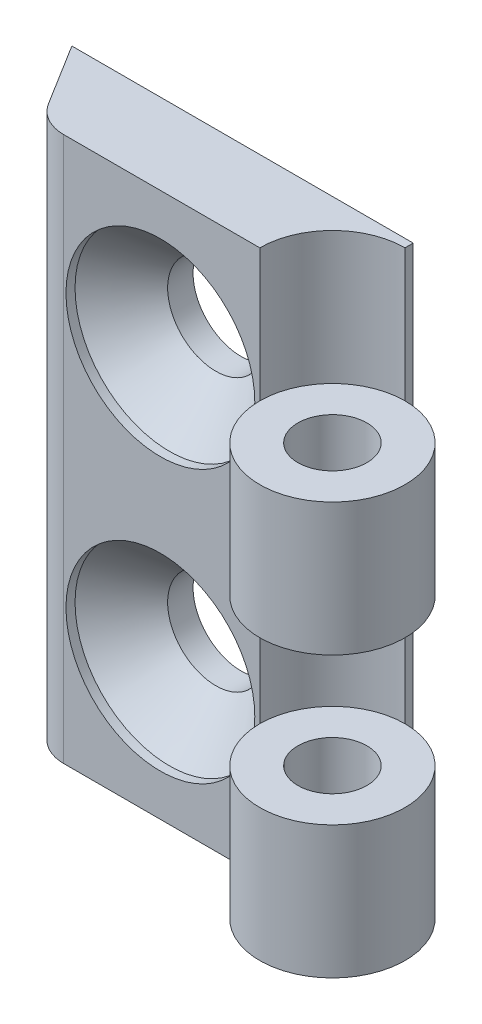
ISO-10303-21;
HEADER;
FILE_DESCRIPTION(('STEP AP214'),'2;1');
FILE_NAME('part.step','',(''),(''),'','','');
FILE_SCHEMA(('AUTOMOTIVE_DESIGN { 1 0 10303 214 1 1 1 1 }'));
ENDSEC;
DATA;
#1=APPLICATION_CONTEXT('core data for automotive mechanical design processes');
#2=APPLICATION_PROTOCOL_DEFINITION('international standard','automotive_design',2000,#1);
#3=PRODUCT_CONTEXT('',#1,'mechanical');
#4=PRODUCT('Part','Part','',(#3));
#5=PRODUCT_RELATED_PRODUCT_CATEGORY('part','',(#4));
#6=PRODUCT_DEFINITION_FORMATION('','',#4);
#7=PRODUCT_DEFINITION_CONTEXT('part definition',#1,'design');
#8=PRODUCT_DEFINITION('design','',#6,#7);
#9=PRODUCT_DEFINITION_SHAPE('','',#8);
#10=(LENGTH_UNIT() NAMED_UNIT(*) SI_UNIT(.MILLI.,.METRE.));
#11=(NAMED_UNIT(*) PLANE_ANGLE_UNIT() SI_UNIT($,.RADIAN.));
#12=(NAMED_UNIT(*) SI_UNIT($,.STERADIAN.) SOLID_ANGLE_UNIT());
#13=UNCERTAINTY_MEASURE_WITH_UNIT(LENGTH_MEASURE(1.E-05),#10,'distance_accuracy_value','');
#14=(GEOMETRIC_REPRESENTATION_CONTEXT(3) GLOBAL_UNCERTAINTY_ASSIGNED_CONTEXT((#13)) GLOBAL_UNIT_ASSIGNED_CONTEXT((#10,
#11,#12)) REPRESENTATION_CONTEXT('',''));
#15=CARTESIAN_POINT('',(0.,0.,0.));
#16=DIRECTION('',(0.,0.,1.));
#17=DIRECTION('',(1.,0.,0.));
#18=AXIS2_PLACEMENT_3D('',#15,#16,#17);
#19=CARTESIAN_POINT('',(0.,30.,0.));
#20=DIRECTION('',(0.,-1.,0.));
#21=DIRECTION('',(0.,0.,-1.));
#22=AXIS2_PLACEMENT_3D('',#19,#20,#21);
#23=CYLINDRICAL_SURFACE('',#22,4.);
#24=DIRECTION('',(0.,-1.,0.));
#25=VECTOR('',#24,1.);
#26=CARTESIAN_POINT('',(0.,30.,-4.));
#27=LINE('',#26,#25);
#28=CARTESIAN_POINT('',(0.,15.4,-4.));
#29=VERTEX_POINT('',#28);
#30=CARTESIAN_POINT('',(0.,7.3,-4.));
#31=VERTEX_POINT('',#30);
#32=EDGE_CURVE('E57',#29,#31,#27,.T.);
#33=ORIENTED_EDGE('',*,*,#32,.F.);
#34=CARTESIAN_POINT('',(0.,15.4,0.));
#35=DIRECTION('',(0.,1.,0.));
#36=DIRECTION('',(0.,0.,1.));
#37=AXIS2_PLACEMENT_3D('',#34,#35,#36);
#38=CIRCLE('',#37,4.);
#39=CARTESIAN_POINT('',(-4.,15.4,0.));
#40=VERTEX_POINT('',#39);
#41=EDGE_CURVE('E167',#29,#40,#38,.T.);
#42=ORIENTED_EDGE('',*,*,#41,.T.);
#43=DIRECTION('',(0.,-1.,0.));
#44=VECTOR('',#43,1.);
#45=CARTESIAN_POINT('',(-4.,30.,0.));
#46=LINE('',#45,#44);
#47=CARTESIAN_POINT('',(-4.,7.3,0.));
#48=VERTEX_POINT('',#47);
#49=EDGE_CURVE('E150',#40,#48,#46,.T.);
#50=ORIENTED_EDGE('',*,*,#49,.T.);
#51=CARTESIAN_POINT('',(0.,7.3,0.));
#52=DIRECTION('',(0.,1.,0.));
#53=DIRECTION('',(0.,0.,1.));
#54=AXIS2_PLACEMENT_3D('',#51,#52,#53);
#55=CIRCLE('',#54,4.);
#56=EDGE_CURVE('E137',#48,#31,#55,.F.);
#57=ORIENTED_EDGE('',*,*,#56,.T.);
#58=EDGE_LOOP('',(#33,#42,#50,#57));
#59=FACE_BOUND('',#58,.T.);
#60=ADVANCED_FACE('F34',(#59),#23,.F.);
#61=CARTESIAN_POINT('',(0.,7.3,0.));
#62=DIRECTION('',(0.,0.,-1.));
#63=DIRECTION('',(-1.,0.,0.));
#64=AXIS2_PLACEMENT_3D('',#61,#62,#63);
#65=PLANE('',#64);
#66=CARTESIAN_POINT('',(-9.475,22.5,0.));
#67=DIRECTION('',(0.,0.,1.));
#68=DIRECTION('',(1.,0.,0.));
#69=AXIS2_PLACEMENT_3D('',#66,#67,#68);
#70=CIRCLE('',#69,5.2);
#71=CARTESIAN_POINT('',(-4.275,22.5,0.));
#72=VERTEX_POINT('',#71);
#73=EDGE_CURVE('E200',#72,#72,#70,.T.);
#74=ORIENTED_EDGE('',*,*,#73,.F.);
#75=EDGE_LOOP('',(#74));
#76=FACE_BOUND('',#75,.T.);
#77=CARTESIAN_POINT('',(-9.475,7.5,0.));
#78=DIRECTION('',(0.,0.,1.));
#79=DIRECTION('',(1.,0.,0.));
#80=AXIS2_PLACEMENT_3D('',#77,#78,#79);
#81=CIRCLE('',#80,5.2);
#82=CARTESIAN_POINT('',(-4.275,7.5,0.));
#83=VERTEX_POINT('',#82);
#84=EDGE_CURVE('E188',#83,#83,#81,.T.);
#85=ORIENTED_EDGE('',*,*,#84,.F.);
#86=EDGE_LOOP('',(#85));
#87=FACE_BOUND('',#86,.T.);
#88=DIRECTION('',(1.,0.,0.));
#89=VECTOR('',#88,1.);
#90=CARTESIAN_POINT('',(0.,0.,0.));
#91=LINE('',#90,#89);
#92=CARTESIAN_POINT('',(-14.8,0.,0.));
#93=VERTEX_POINT('',#92);
#94=CARTESIAN_POINT('',(-4.,0.,0.));
#95=VERTEX_POINT('',#94);
#96=EDGE_CURVE('E103',#93,#95,#91,.T.);
#97=ORIENTED_EDGE('',*,*,#96,.T.);
#98=DIRECTION('',(0.,-1.,0.));
#99=VECTOR('',#98,1.);
#100=CARTESIAN_POINT('',(-4.,7.3,0.));
#101=LINE('',#100,#99);
#102=EDGE_CURVE('E11',#48,#95,#101,.T.);
#103=ORIENTED_EDGE('',*,*,#102,.F.);
#104=ORIENTED_EDGE('',*,*,#49,.F.);
#105=CARTESIAN_POINT('',(-4.,22.7,0.));
#106=VERTEX_POINT('',#105);
#107=EDGE_CURVE('E149',#106,#40,#46,.T.);
#108=ORIENTED_EDGE('',*,*,#107,.F.);
#109=CARTESIAN_POINT('',(-4.,30.,0.));
#110=VERTEX_POINT('',#109);
#111=EDGE_CURVE('E146',#110,#106,#46,.T.);
#112=ORIENTED_EDGE('',*,*,#111,.F.);
#113=DIRECTION('',(1.,0.,0.));
#114=VECTOR('',#113,1.);
#115=CARTESIAN_POINT('',(0.,30.,0.));
#116=LINE('',#115,#114);
#117=CARTESIAN_POINT('',(-14.8,30.,0.));
#118=VERTEX_POINT('',#117);
#119=EDGE_CURVE('E151',#118,#110,#116,.T.);
#120=ORIENTED_EDGE('',*,*,#119,.F.);
#121=DIRECTION('',(0.,-1.,0.));
#122=VECTOR('',#121,1.);
#123=CARTESIAN_POINT('',(-14.8,7.3,0.));
#124=LINE('',#123,#122);
#125=EDGE_CURVE('E94',#118,#93,#124,.T.);
#126=ORIENTED_EDGE('',*,*,#125,.T.);
#127=EDGE_LOOP('',(#97,#103,#104,#108,#112,#120,#126));
#128=FACE_BOUND('',#127,.T.);
#129=ADVANCED_FACE('F206',(#76,#87,#128),#65,.F.);
#130=CARTESIAN_POINT('',(0.,7.3,0.));
#131=DIRECTION('',(0.,-1.,0.));
#132=DIRECTION('',(0.,0.,-1.));
#133=AXIS2_PLACEMENT_3D('',#130,#131,#132);
#134=CYLINDRICAL_SURFACE('',#133,4.);
#135=CARTESIAN_POINT('',(0.,0.,0.));
#136=DIRECTION('',(0.,1.,0.));
#137=DIRECTION('',(0.,0.,1.));
#138=AXIS2_PLACEMENT_3D('',#135,#136,#137);
#139=CIRCLE('',#138,4.);
#140=CARTESIAN_POINT('',(0.,0.,-4.));
#141=VERTEX_POINT('',#140);
#142=EDGE_CURVE('E128',#95,#141,#139,.T.);
#143=ORIENTED_EDGE('',*,*,#142,.T.);
#144=DIRECTION('',(0.,-1.,0.));
#145=VECTOR('',#144,1.);
#146=CARTESIAN_POINT('',(0.,7.3,-4.));
#147=LINE('',#146,#145);
#148=EDGE_CURVE('E42',#31,#141,#147,.T.);
#149=ORIENTED_EDGE('',*,*,#148,.F.);
#150=CARTESIAN_POINT('',(0.,7.3,0.));
#151=DIRECTION('',(0.,1.,0.));
#152=DIRECTION('',(0.,0.,1.));
#153=AXIS2_PLACEMENT_3D('',#150,#151,#152);
#154=CIRCLE('',#153,4.);
#155=EDGE_CURVE('E115',#48,#31,#154,.T.);
#156=ORIENTED_EDGE('',*,*,#155,.F.);
#157=ORIENTED_EDGE('',*,*,#102,.T.);
#158=EDGE_LOOP('',(#143,#149,#156,#157));
#159=FACE_BOUND('',#158,.T.);
#160=ADVANCED_FACE('F129',(#159),#134,.T.);
#161=CARTESIAN_POINT('',(0.,7.3,0.));
#162=DIRECTION('',(1.,0.,0.));
#163=DIRECTION('',(0.,0.,-1.));
#164=AXIS2_PLACEMENT_3D('',#161,#162,#163);
#165=PLANE('',#164);
#166=DIRECTION('',(0.,0.,1.));
#167=VECTOR('',#166,1.);
#168=CARTESIAN_POINT('',(0.,0.,0.));
#169=LINE('',#168,#167);
#170=CARTESIAN_POINT('',(0.,0.,-4.45));
#171=VERTEX_POINT('',#170);
#172=EDGE_CURVE('E111',#171,#141,#169,.T.);
#173=ORIENTED_EDGE('',*,*,#172,.F.);
#174=DIRECTION('',(0.,-1.,0.));
#175=VECTOR('',#174,1.);
#176=CARTESIAN_POINT('',(0.,7.3,-4.45));
#177=LINE('',#176,#175);
#178=CARTESIAN_POINT('',(0.,30.,-4.45));
#179=VERTEX_POINT('',#178);
#180=EDGE_CURVE('E118',#179,#171,#177,.T.);
#181=ORIENTED_EDGE('',*,*,#180,.F.);
#182=DIRECTION('',(0.,0.,1.));
#183=VECTOR('',#182,1.);
#184=CARTESIAN_POINT('',(0.,30.,0.));
#185=LINE('',#184,#183);
#186=CARTESIAN_POINT('',(0.,30.,-4.));
#187=VERTEX_POINT('',#186);
#188=EDGE_CURVE('E160',#179,#187,#185,.T.);
#189=ORIENTED_EDGE('',*,*,#188,.T.);
#190=CARTESIAN_POINT('',(0.,22.7,-4.));
#191=VERTEX_POINT('',#190);
#192=EDGE_CURVE('E142',#187,#191,#27,.T.);
#193=ORIENTED_EDGE('',*,*,#192,.T.);
#194=EDGE_CURVE('E145',#191,#29,#27,.T.);
#195=ORIENTED_EDGE('',*,*,#194,.T.);
#196=ORIENTED_EDGE('',*,*,#32,.T.);
#197=ORIENTED_EDGE('',*,*,#148,.T.);
#198=EDGE_LOOP('',(#173,#181,#189,#193,#195,#196,#197));
#199=FACE_BOUND('',#198,.T.);
#200=ADVANCED_FACE('F122',(#199),#165,.T.);
#201=CARTESIAN_POINT('',(0.,7.3,-4.45));
#202=DIRECTION('',(0.,0.,1.));
#203=DIRECTION('',(1.,0.,0.));
#204=AXIS2_PLACEMENT_3D('',#201,#202,#203);
#205=PLANE('',#204);
#206=CARTESIAN_POINT('',(-9.475,22.5,-4.45));
#207=DIRECTION('',(0.,0.,1.));
#208=DIRECTION('',(1.,0.,0.));
#209=AXIS2_PLACEMENT_3D('',#206,#207,#208);
#210=CIRCLE('',#209,2.65);
#211=CARTESIAN_POINT('',(-6.825,22.5,-4.45));
#212=VERTEX_POINT('',#211);
#213=EDGE_CURVE('E191',#212,#212,#210,.T.);
#214=ORIENTED_EDGE('',*,*,#213,.T.);
#215=EDGE_LOOP('',(#214));
#216=FACE_BOUND('',#215,.T.);
#217=CARTESIAN_POINT('',(-9.475,7.5,-4.45));
#218=DIRECTION('',(0.,0.,1.));
#219=DIRECTION('',(1.,0.,0.));
#220=AXIS2_PLACEMENT_3D('',#217,#218,#219);
#221=CIRCLE('',#220,2.65);
#222=CARTESIAN_POINT('',(-6.825,7.5,-4.45));
#223=VERTEX_POINT('',#222);
#224=EDGE_CURVE('E174',#223,#223,#221,.T.);
#225=ORIENTED_EDGE('',*,*,#224,.T.);
#226=EDGE_LOOP('',(#225));
#227=FACE_BOUND('',#226,.T.);
#228=DIRECTION('',(-1.,0.,0.));
#229=VECTOR('',#228,1.);
#230=CARTESIAN_POINT('',(0.,0.,-4.45));
#231=LINE('',#230,#229);
#232=CARTESIAN_POINT('',(-18.8,0.,-4.45));
#233=VERTEX_POINT('',#232);
#234=EDGE_CURVE('E109',#171,#233,#231,.T.);
#235=ORIENTED_EDGE('',*,*,#234,.T.);
#236=DIRECTION('',(0.,-1.,0.));
#237=VECTOR('',#236,1.);
#238=CARTESIAN_POINT('',(-18.8,7.3,-4.45));
#239=LINE('',#238,#237);
#240=CARTESIAN_POINT('',(-18.8,30.,-4.45));
#241=VERTEX_POINT('',#240);
#242=EDGE_CURVE('E93',#241,#233,#239,.T.);
#243=ORIENTED_EDGE('',*,*,#242,.F.);
#244=DIRECTION('',(-1.,0.,0.));
#245=VECTOR('',#244,1.);
#246=CARTESIAN_POINT('',(0.,30.,-4.45));
#247=LINE('',#246,#245);
#248=EDGE_CURVE('E157',#179,#241,#247,.T.);
#249=ORIENTED_EDGE('',*,*,#248,.F.);
#250=ORIENTED_EDGE('',*,*,#180,.T.);
#251=EDGE_LOOP('',(#235,#243,#249,#250));
#252=FACE_BOUND('',#251,.T.);
#253=ADVANCED_FACE('F247',(#216,#227,#252),#205,.F.);
#254=CARTESIAN_POINT('',(-11.5767575609371,7.3,7.18628851544268));
#255=DIRECTION('',(-0.849616658214253,0.,0.527400733868322));
#256=DIRECTION('',(0.527400733868322,0.,0.849616658214253));
#257=AXIS2_PLACEMENT_3D('',#254,#255,#256);
#258=PLANE('',#257);
#259=DIRECTION('',(-0.527400733868322,0.,-0.849616658214253));
#260=VECTOR('',#259,1.);
#261=CARTESIAN_POINT('',(-11.5767575609371,0.,7.18628851544268));
#262=LINE('',#261,#260);
#263=CARTESIAN_POINT('',(-16.6903970645267,0.,-1.05153336714298));
#264=VERTEX_POINT('',#263);
#265=EDGE_CURVE('E101',#264,#233,#262,.T.);
#266=ORIENTED_EDGE('',*,*,#265,.F.);
#267=DIRECTION('',(0.,-1.,0.));
#268=VECTOR('',#267,1.);
#269=CARTESIAN_POINT('',(-16.6903970645267,7.3,-1.05153336714298));
#270=LINE('',#269,#268);
#271=CARTESIAN_POINT('',(-16.6903970645267,30.,-1.05153336714298));
#272=VERTEX_POINT('',#271);
#273=EDGE_CURVE('E80',#272,#264,#270,.T.);
#274=ORIENTED_EDGE('',*,*,#273,.F.);
#275=DIRECTION('',(-0.527400733868322,0.,-0.849616658214253));
#276=VECTOR('',#275,1.);
#277=CARTESIAN_POINT('',(-11.5767575609371,30.,7.18628851544268));
#278=LINE('',#277,#276);
#279=EDGE_CURVE('E155',#272,#241,#278,.T.);
#280=ORIENTED_EDGE('',*,*,#279,.T.);
#281=ORIENTED_EDGE('',*,*,#242,.T.);
#282=EDGE_LOOP('',(#266,#274,#280,#281));
#283=FACE_BOUND('',#282,.T.);
#284=ADVANCED_FACE('F106',(#283),#258,.T.);
#285=CARTESIAN_POINT('',(0.,7.3,0.));
#286=DIRECTION('',(0.,-1.,0.));
#287=DIRECTION('',(0.,0.,-1.));
#288=AXIS2_PLACEMENT_3D('',#285,#286,#287);
#289=CYLINDRICAL_SURFACE('',#288,1.9);
#290=CARTESIAN_POINT('',(0.,7.3,0.));
#291=DIRECTION('',(0.,1.,0.));
#292=DIRECTION('',(0.,0.,1.));
#293=AXIS2_PLACEMENT_3D('',#290,#291,#292);
#294=CIRCLE('',#293,1.9);
#295=CARTESIAN_POINT('',(0.,7.3,1.9));
#296=VERTEX_POINT('',#295);
#297=EDGE_CURVE('E104',#296,#296,#294,.T.);
#298=ORIENTED_EDGE('',*,*,#297,.T.);
#299=EDGE_LOOP('',(#298));
#300=FACE_BOUND('',#299,.T.);
#301=CARTESIAN_POINT('',(0.,0.,0.));
#302=DIRECTION('',(0.,1.,0.));
#303=DIRECTION('',(0.,0.,1.));
#304=AXIS2_PLACEMENT_3D('',#301,#302,#303);
#305=CIRCLE('',#304,1.9);
#306=CARTESIAN_POINT('',(0.,0.,1.9));
#307=VERTEX_POINT('',#306);
#308=EDGE_CURVE('E134',#307,#307,#305,.T.);
#309=ORIENTED_EDGE('',*,*,#308,.F.);
#310=EDGE_LOOP('',(#309));
#311=FACE_BOUND('',#310,.T.);
#312=ADVANCED_FACE('F36',(#300,#311),#289,.F.);
#313=CARTESIAN_POINT('',(-14.8,7.3,-2.225));
#314=DIRECTION('',(0.,-1.,0.));
#315=DIRECTION('',(0.,0.,-1.));
#316=AXIS2_PLACEMENT_3D('',#313,#314,#315);
#317=CYLINDRICAL_SURFACE('',#316,2.225);
#318=CARTESIAN_POINT('',(-14.8,0.,-2.225));
#319=DIRECTION('',(0.,1.,0.));
#320=DIRECTION('',(0.,0.,1.));
#321=AXIS2_PLACEMENT_3D('',#318,#319,#320);
#322=CIRCLE('',#321,2.225);
#323=EDGE_CURVE('E84',#264,#93,#322,.T.);
#324=ORIENTED_EDGE('',*,*,#323,.T.);
#325=ORIENTED_EDGE('',*,*,#125,.F.);
#326=CARTESIAN_POINT('',(-14.8,30.,-2.225));
#327=DIRECTION('',(0.,1.,0.));
#328=DIRECTION('',(0.,0.,1.));
#329=AXIS2_PLACEMENT_3D('',#326,#327,#328);
#330=CIRCLE('',#329,2.225);
#331=EDGE_CURVE('E88',#272,#118,#330,.T.);
#332=ORIENTED_EDGE('',*,*,#331,.F.);
#333=ORIENTED_EDGE('',*,*,#273,.T.);
#334=EDGE_LOOP('',(#324,#325,#332,#333));
#335=FACE_BOUND('',#334,.T.);
#336=ADVANCED_FACE('F82',(#335),#317,.T.);
#337=CARTESIAN_POINT('',(0.,7.3,0.));
#338=DIRECTION('',(0.,1.,0.));
#339=DIRECTION('',(0.,0.,1.));
#340=AXIS2_PLACEMENT_3D('',#337,#338,#339);
#341=PLANE('',#340);
#342=ORIENTED_EDGE('',*,*,#56,.F.);
#343=ORIENTED_EDGE('',*,*,#155,.T.);
#344=EDGE_LOOP('',(#342,#343));
#345=FACE_BOUND('',#344,.T.);
#346=ORIENTED_EDGE('',*,*,#297,.F.);
#347=EDGE_LOOP('',(#346));
#348=FACE_BOUND('',#347,.T.);
#349=ADVANCED_FACE('F269',(#345,#348),#341,.T.);
#350=CARTESIAN_POINT('',(0.,0.,0.));
#351=DIRECTION('',(0.,1.,0.));
#352=DIRECTION('',(0.,0.,1.));
#353=AXIS2_PLACEMENT_3D('',#350,#351,#352);
#354=PLANE('',#353);
#355=ORIENTED_EDGE('',*,*,#308,.T.);
#356=EDGE_LOOP('',(#355));
#357=FACE_BOUND('',#356,.T.);
#358=ORIENTED_EDGE('',*,*,#142,.F.);
#359=ORIENTED_EDGE('',*,*,#96,.F.);
#360=ORIENTED_EDGE('',*,*,#323,.F.);
#361=ORIENTED_EDGE('',*,*,#265,.T.);
#362=ORIENTED_EDGE('',*,*,#234,.F.);
#363=ORIENTED_EDGE('',*,*,#172,.T.);
#364=EDGE_LOOP('',(#358,#359,#360,#361,#362,#363));
#365=FACE_BOUND('',#364,.T.);
#366=ADVANCED_FACE('F99',(#357,#365),#354,.F.);
#367=CARTESIAN_POINT('',(0.,22.7,0.));
#368=DIRECTION('',(0.,1.,0.));
#369=DIRECTION('',(0.,0.,1.));
#370=AXIS2_PLACEMENT_3D('',#367,#368,#369);
#371=CIRCLE('',#370,4.);
#372=EDGE_CURVE('E166',#191,#106,#371,.T.);
#373=ORIENTED_EDGE('',*,*,#372,.F.);
#374=ORIENTED_EDGE('',*,*,#192,.F.);
#375=CARTESIAN_POINT('',(0.,30.,0.));
#376=DIRECTION('',(0.,1.,0.));
#377=DIRECTION('',(0.,0.,1.));
#378=AXIS2_PLACEMENT_3D('',#375,#376,#377);
#379=CIRCLE('',#378,4.);
#380=EDGE_CURVE('E163',#187,#110,#379,.T.);
#381=ORIENTED_EDGE('',*,*,#380,.T.);
#382=ORIENTED_EDGE('',*,*,#111,.T.);
#383=EDGE_LOOP('',(#373,#374,#381,#382));
#384=FACE_BOUND('',#383,.T.);
#385=ADVANCED_FACE('F245',(#384),#23,.F.);
#386=CARTESIAN_POINT('',(0.,30.,0.));
#387=DIRECTION('',(0.,1.,0.));
#388=DIRECTION('',(0.,0.,1.));
#389=AXIS2_PLACEMENT_3D('',#386,#387,#388);
#390=PLANE('',#389);
#391=ORIENTED_EDGE('',*,*,#380,.F.);
#392=ORIENTED_EDGE('',*,*,#188,.F.);
#393=ORIENTED_EDGE('',*,*,#248,.T.);
#394=ORIENTED_EDGE('',*,*,#279,.F.);
#395=ORIENTED_EDGE('',*,*,#331,.T.);
#396=ORIENTED_EDGE('',*,*,#119,.T.);
#397=EDGE_LOOP('',(#391,#392,#393,#394,#395,#396));
#398=FACE_BOUND('',#397,.T.);
#399=ADVANCED_FACE('F219',(#398),#390,.T.);
#400=CARTESIAN_POINT('',(0.,22.7,0.));
#401=DIRECTION('',(0.,-1.,0.));
#402=DIRECTION('',(0.,0.,-1.));
#403=AXIS2_PLACEMENT_3D('',#400,#401,#402);
#404=CYLINDRICAL_SURFACE('',#403,4.);
#405=EDGE_CURVE('E177',#106,#191,#371,.T.);
#406=ORIENTED_EDGE('',*,*,#405,.F.);
#407=ORIENTED_EDGE('',*,*,#107,.T.);
#408=EDGE_CURVE('E48',#40,#29,#38,.T.);
#409=ORIENTED_EDGE('',*,*,#408,.T.);
#410=ORIENTED_EDGE('',*,*,#194,.F.);
#411=EDGE_LOOP('',(#406,#407,#409,#410));
#412=FACE_BOUND('',#411,.T.);
#413=ADVANCED_FACE('F236',(#412),#404,.T.);
#414=CARTESIAN_POINT('',(0.,22.7,0.));
#415=DIRECTION('',(0.,-1.,0.));
#416=DIRECTION('',(0.,0.,-1.));
#417=AXIS2_PLACEMENT_3D('',#414,#415,#416);
#418=CYLINDRICAL_SURFACE('',#417,1.9);
#419=CARTESIAN_POINT('',(0.,22.7,0.));
#420=DIRECTION('',(0.,1.,0.));
#421=DIRECTION('',(0.,0.,1.));
#422=AXIS2_PLACEMENT_3D('',#419,#420,#421);
#423=CIRCLE('',#422,1.9);
#424=CARTESIAN_POINT('',(0.,22.7,1.9));
#425=VERTEX_POINT('',#424);
#426=EDGE_CURVE('E170',#425,#425,#423,.T.);
#427=ORIENTED_EDGE('',*,*,#426,.T.);
#428=EDGE_LOOP('',(#427));
#429=FACE_BOUND('',#428,.T.);
#430=CARTESIAN_POINT('',(0.,15.4,0.));
#431=DIRECTION('',(0.,1.,0.));
#432=DIRECTION('',(0.,0.,1.));
#433=AXIS2_PLACEMENT_3D('',#430,#431,#432);
#434=CIRCLE('',#433,1.9);
#435=CARTESIAN_POINT('',(0.,15.4,1.9));
#436=VERTEX_POINT('',#435);
#437=EDGE_CURVE('E171',#436,#436,#434,.T.);
#438=ORIENTED_EDGE('',*,*,#437,.F.);
#439=EDGE_LOOP('',(#438));
#440=FACE_BOUND('',#439,.T.);
#441=ADVANCED_FACE('F347',(#429,#440),#418,.F.);
#442=CARTESIAN_POINT('',(0.,22.7,0.));
#443=DIRECTION('',(0.,1.,0.));
#444=DIRECTION('',(0.,0.,1.));
#445=AXIS2_PLACEMENT_3D('',#442,#443,#444);
#446=PLANE('',#445);
#447=ORIENTED_EDGE('',*,*,#426,.F.);
#448=EDGE_LOOP('',(#447));
#449=FACE_BOUND('',#448,.T.);
#450=ORIENTED_EDGE('',*,*,#372,.T.);
#451=ORIENTED_EDGE('',*,*,#405,.T.);
#452=EDGE_LOOP('',(#450,#451));
#453=FACE_BOUND('',#452,.T.);
#454=ADVANCED_FACE('F356',(#449,#453),#446,.T.);
#455=CARTESIAN_POINT('',(0.,15.4,0.));
#456=DIRECTION('',(0.,1.,0.));
#457=DIRECTION('',(0.,0.,1.));
#458=AXIS2_PLACEMENT_3D('',#455,#456,#457);
#459=PLANE('',#458);
#460=ORIENTED_EDGE('',*,*,#437,.T.);
#461=EDGE_LOOP('',(#460));
#462=FACE_BOUND('',#461,.T.);
#463=ORIENTED_EDGE('',*,*,#41,.F.);
#464=ORIENTED_EDGE('',*,*,#408,.F.);
#465=EDGE_LOOP('',(#463,#464));
#466=FACE_BOUND('',#465,.T.);
#467=ADVANCED_FACE('F367',(#462,#466),#459,.F.);
#468=CARTESIAN_POINT('',(-9.475,7.5,0.));
#469=DIRECTION('',(0.,0.,1.));
#470=DIRECTION('',(1.,0.,0.));
#471=AXIS2_PLACEMENT_3D('',#468,#469,#470);
#472=CYLINDRICAL_SURFACE('',#471,2.65);
#473=ORIENTED_EDGE('',*,*,#224,.F.);
#474=EDGE_LOOP('',(#473));
#475=FACE_BOUND('',#474,.T.);
#476=CARTESIAN_POINT('',(-9.475,7.5,-3.05));
#477=DIRECTION('',(0.,0.,1.));
#478=DIRECTION('',(1.,0.,0.));
#479=AXIS2_PLACEMENT_3D('',#476,#477,#478);
#480=CIRCLE('',#479,2.65);
#481=CARTESIAN_POINT('',(-6.825,7.5,-3.05));
#482=VERTEX_POINT('',#481);
#483=EDGE_CURVE('E182',#482,#482,#480,.T.);
#484=ORIENTED_EDGE('',*,*,#483,.T.);
#485=EDGE_LOOP('',(#484));
#486=FACE_BOUND('',#485,.T.);
#487=ADVANCED_FACE('F379',(#475,#486),#472,.F.);
#488=CARTESIAN_POINT('',(-9.475,7.5,-0.5));
#489=DIRECTION('',(0.,0.,1.));
#490=DIRECTION('',(1.,0.,0.));
#491=AXIS2_PLACEMENT_3D('',#488,#489,#490);
#492=CONICAL_SURFACE('',#491,5.2,0.785398163397448);
#493=ORIENTED_EDGE('',*,*,#483,.F.);
#494=EDGE_LOOP('',(#493));
#495=FACE_BOUND('',#494,.T.);
#496=CARTESIAN_POINT('',(-9.475,7.5,-0.5));
#497=DIRECTION('',(0.,0.,1.));
#498=DIRECTION('',(1.,0.,0.));
#499=AXIS2_PLACEMENT_3D('',#496,#497,#498);
#500=CIRCLE('',#499,5.2);
#501=CARTESIAN_POINT('',(-4.275,7.5,-0.5));
#502=VERTEX_POINT('',#501);
#503=EDGE_CURVE('E185',#502,#502,#500,.T.);
#504=ORIENTED_EDGE('',*,*,#503,.T.);
#505=EDGE_LOOP('',(#504));
#506=FACE_BOUND('',#505,.T.);
#507=ADVANCED_FACE('F400',(#495,#506),#492,.F.);
#508=CARTESIAN_POINT('',(-9.475,7.5,0.));
#509=DIRECTION('',(0.,0.,1.));
#510=DIRECTION('',(1.,0.,0.));
#511=AXIS2_PLACEMENT_3D('',#508,#509,#510);
#512=CYLINDRICAL_SURFACE('',#511,5.2);
#513=ORIENTED_EDGE('',*,*,#503,.F.);
#514=EDGE_LOOP('',(#513));
#515=FACE_BOUND('',#514,.T.);
#516=ORIENTED_EDGE('',*,*,#84,.T.);
#517=EDGE_LOOP('',(#516));
#518=FACE_BOUND('',#517,.T.);
#519=ADVANCED_FACE('F410',(#515,#518),#512,.F.);
#520=CARTESIAN_POINT('',(-9.475,22.5,0.));
#521=DIRECTION('',(0.,0.,1.));
#522=DIRECTION('',(1.,0.,0.));
#523=AXIS2_PLACEMENT_3D('',#520,#521,#522);
#524=CYLINDRICAL_SURFACE('',#523,2.65);
#525=ORIENTED_EDGE('',*,*,#213,.F.);
#526=EDGE_LOOP('',(#525));
#527=FACE_BOUND('',#526,.T.);
#528=CARTESIAN_POINT('',(-9.475,22.5,-3.05));
#529=DIRECTION('',(0.,0.,1.));
#530=DIRECTION('',(1.,0.,0.));
#531=AXIS2_PLACEMENT_3D('',#528,#529,#530);
#532=CIRCLE('',#531,2.65);
#533=CARTESIAN_POINT('',(-6.825,22.5,-3.05));
#534=VERTEX_POINT('',#533);
#535=EDGE_CURVE('E194',#534,#534,#532,.T.);
#536=ORIENTED_EDGE('',*,*,#535,.T.);
#537=EDGE_LOOP('',(#536));
#538=FACE_BOUND('',#537,.T.);
#539=ADVANCED_FACE('F420',(#527,#538),#524,.F.);
#540=CARTESIAN_POINT('',(-9.475,22.5,-0.5));
#541=DIRECTION('',(0.,0.,1.));
#542=DIRECTION('',(1.,0.,0.));
#543=AXIS2_PLACEMENT_3D('',#540,#541,#542);
#544=CONICAL_SURFACE('',#543,5.2,0.785398163397448);
#545=ORIENTED_EDGE('',*,*,#535,.F.);
#546=EDGE_LOOP('',(#545));
#547=FACE_BOUND('',#546,.T.);
#548=CARTESIAN_POINT('',(-9.475,22.5,-0.5));
#549=DIRECTION('',(0.,0.,1.));
#550=DIRECTION('',(1.,0.,0.));
#551=AXIS2_PLACEMENT_3D('',#548,#549,#550);
#552=CIRCLE('',#551,5.2);
#553=CARTESIAN_POINT('',(-4.275,22.5,-0.5));
#554=VERTEX_POINT('',#553);
#555=EDGE_CURVE('E197',#554,#554,#552,.T.);
#556=ORIENTED_EDGE('',*,*,#555,.T.);
#557=EDGE_LOOP('',(#556));
#558=FACE_BOUND('',#557,.T.);
#559=ADVANCED_FACE('F430',(#547,#558),#544,.F.);
#560=CARTESIAN_POINT('',(-9.475,22.5,0.));
#561=DIRECTION('',(0.,0.,1.));
#562=DIRECTION('',(1.,0.,0.));
#563=AXIS2_PLACEMENT_3D('',#560,#561,#562);
#564=CYLINDRICAL_SURFACE('',#563,5.2);
#565=ORIENTED_EDGE('',*,*,#555,.F.);
#566=EDGE_LOOP('',(#565));
#567=FACE_BOUND('',#566,.T.);
#568=ORIENTED_EDGE('',*,*,#73,.T.);
#569=EDGE_LOOP('',(#568));
#570=FACE_BOUND('',#569,.T.);
#571=ADVANCED_FACE('F204',(#567,#570),#564,.F.);
#572=CLOSED_SHELL('',(#60,#129,#160,#200,#253,#284,#312,#336,#349,#366,#385,#399,#413,#441,#454,
#467,#487,#507,#519,#539,#559,#571));
#573=MANIFOLD_SOLID_BREP('B2',#572);
#574=ADVANCED_BREP_SHAPE_REPRESENTATION('',(#18,#573),#14);
#575=SHAPE_DEFINITION_REPRESENTATION(#9,#574);
ENDSEC;
END-ISO-10303-21;
